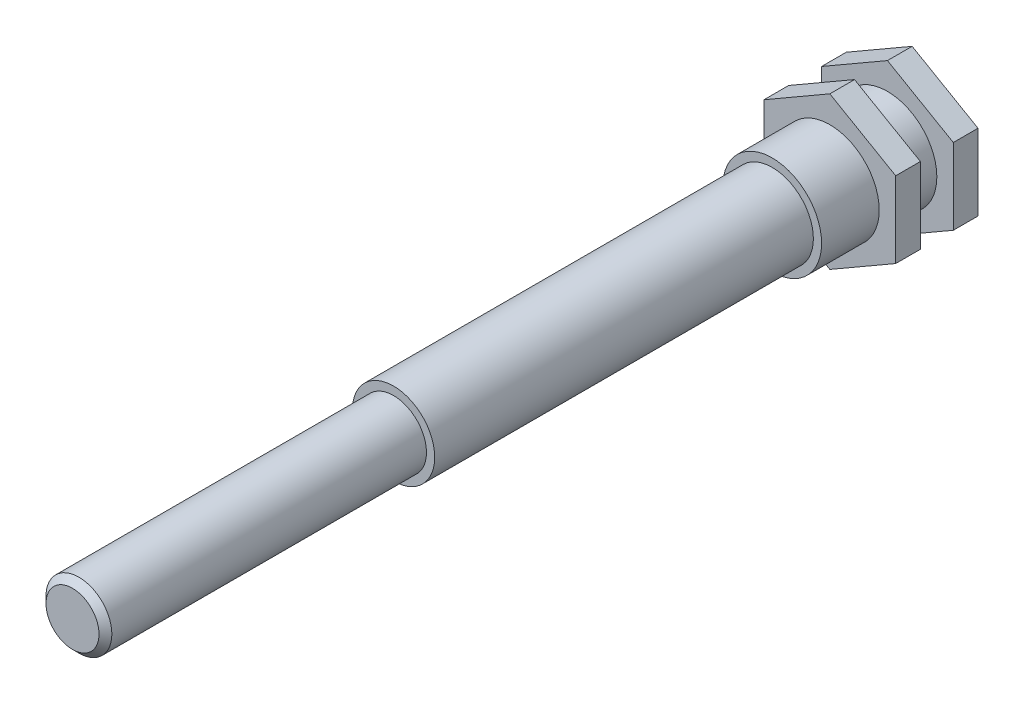
ISO-10303-21;
HEADER;
FILE_DESCRIPTION(('STEP AP214'),'2;1');
FILE_NAME('part.step','',(''),(''),'','','');
FILE_SCHEMA(('AUTOMOTIVE_DESIGN { 1 0 10303 214 1 1 1 1 }'));
ENDSEC;
DATA;
#1=APPLICATION_CONTEXT('core data for automotive mechanical design processes');
#2=APPLICATION_PROTOCOL_DEFINITION('international standard','automotive_design',2000,#1);
#3=PRODUCT_CONTEXT('',#1,'mechanical');
#4=PRODUCT('Part','Part','',(#3));
#5=PRODUCT_RELATED_PRODUCT_CATEGORY('part','',(#4));
#6=PRODUCT_DEFINITION_FORMATION('','',#4);
#7=PRODUCT_DEFINITION_CONTEXT('part definition',#1,'design');
#8=PRODUCT_DEFINITION('design','',#6,#7);
#9=PRODUCT_DEFINITION_SHAPE('','',#8);
#10=(LENGTH_UNIT() NAMED_UNIT(*) SI_UNIT(.MILLI.,.METRE.));
#11=(NAMED_UNIT(*) PLANE_ANGLE_UNIT() SI_UNIT($,.RADIAN.));
#12=(NAMED_UNIT(*) SI_UNIT($,.STERADIAN.) SOLID_ANGLE_UNIT());
#13=UNCERTAINTY_MEASURE_WITH_UNIT(LENGTH_MEASURE(1.E-05),#10,'distance_accuracy_value','');
#14=(GEOMETRIC_REPRESENTATION_CONTEXT(3) GLOBAL_UNCERTAINTY_ASSIGNED_CONTEXT((#13)) GLOBAL_UNIT_ASSIGNED_CONTEXT((#10,
#11,#12)) REPRESENTATION_CONTEXT('',''));
#15=CARTESIAN_POINT('',(0.,0.,0.));
#16=DIRECTION('',(0.,0.,1.));
#17=DIRECTION('',(1.,0.,0.));
#18=AXIS2_PLACEMENT_3D('',#15,#16,#17);
#19=CARTESIAN_POINT('',(0.,0.,31.4999999999998));
#20=DIRECTION('',(0.,0.,0.999999999999996));
#21=DIRECTION('',(1.,0.,0.));
#22=AXIS2_PLACEMENT_3D('',#19,#20,#21);
#23=PLANE('',#22);
#24=CARTESIAN_POINT('',(0.,0.,31.4999999999998));
#25=DIRECTION('',(0.,0.,0.999999999999996));
#26=DIRECTION('',(1.,0.,0.));
#27=AXIS2_PLACEMENT_3D('',#24,#25,#26);
#28=CIRCLE('',#27,2.5);
#29=CARTESIAN_POINT('',(2.5,0.,31.4999999999998));
#30=VERTEX_POINT('',#29);
#31=EDGE_CURVE('E293',#30,#30,#28,.T.);
#32=ORIENTED_EDGE('',*,*,#31,.T.);
#33=EDGE_LOOP('',(#32));
#34=FACE_BOUND('',#33,.T.);
#35=CARTESIAN_POINT('',(0.,0.,31.4999999999998));
#36=DIRECTION('',(0.,0.,0.999999999999996));
#37=DIRECTION('',(1.,0.,0.));
#38=AXIS2_PLACEMENT_3D('',#35,#36,#37);
#39=CIRCLE('',#38,2.);
#40=CARTESIAN_POINT('',(2.,0.,31.4999999999998));
#41=VERTEX_POINT('',#40);
#42=EDGE_CURVE('E313',#41,#41,#39,.T.);
#43=ORIENTED_EDGE('',*,*,#42,.F.);
#44=EDGE_LOOP('',(#43));
#45=FACE_BOUND('',#44,.T.);
#46=ADVANCED_FACE('F36',(#34,#45),#23,.T.);
#47=CARTESIAN_POINT('',(0.,0.,8.49999999999994));
#48=DIRECTION('',(0.,0.,0.999999999999996));
#49=DIRECTION('',(1.,0.,0.));
#50=AXIS2_PLACEMENT_3D('',#47,#48,#49);
#51=PLANE('',#50);
#52=CARTESIAN_POINT('',(0.,0.,8.49999999999994));
#53=DIRECTION('',(0.,0.,0.999999999999996));
#54=DIRECTION('',(1.,0.,0.));
#55=AXIS2_PLACEMENT_3D('',#52,#53,#54);
#56=CIRCLE('',#55,3.);
#57=CARTESIAN_POINT('',(3.,0.,8.49999999999994));
#58=VERTEX_POINT('',#57);
#59=EDGE_CURVE('E131',#58,#58,#56,.T.);
#60=ORIENTED_EDGE('',*,*,#59,.T.);
#61=EDGE_LOOP('',(#60));
#62=FACE_BOUND('',#61,.T.);
#63=CARTESIAN_POINT('',(0.,0.,8.49999999999994));
#64=DIRECTION('',(0.,0.,0.999999999999996));
#65=DIRECTION('',(1.,0.,0.));
#66=AXIS2_PLACEMENT_3D('',#63,#64,#65);
#67=CIRCLE('',#66,2.5);
#68=CARTESIAN_POINT('',(2.5,0.,8.49999999999994));
#69=VERTEX_POINT('',#68);
#70=EDGE_CURVE('E310',#69,#69,#67,.T.);
#71=ORIENTED_EDGE('',*,*,#70,.F.);
#72=EDGE_LOOP('',(#71));
#73=FACE_BOUND('',#72,.T.);
#74=ADVANCED_FACE('F168',(#62,#73),#51,.T.);
#75=CARTESIAN_POINT('',(0.,0.,8.49999999999994));
#76=DIRECTION('',(0.,0.,-0.999999999999996));
#77=DIRECTION('',(-1.,0.,0.));
#78=AXIS2_PLACEMENT_3D('',#75,#76,#77);
#79=CYLINDRICAL_SURFACE('',#78,3.);
#80=CARTESIAN_POINT('',(0.,0.,1.49999999999999));
#81=DIRECTION('',(0.,0.,0.999999999999996));
#82=DIRECTION('',(1.,0.,0.));
#83=AXIS2_PLACEMENT_3D('',#80,#81,#82);
#84=CIRCLE('',#83,3.);
#85=CARTESIAN_POINT('',(3.,0.,1.49999999999999));
#86=VERTEX_POINT('',#85);
#87=EDGE_CURVE('E152',#86,#86,#84,.T.);
#88=ORIENTED_EDGE('',*,*,#87,.T.);
#89=EDGE_LOOP('',(#88));
#90=FACE_BOUND('',#89,.T.);
#91=CARTESIAN_POINT('',(0.,0.,3.49999999999997));
#92=DIRECTION('',(0.,0.,0.999999999999996));
#93=DIRECTION('',(1.,0.,0.));
#94=AXIS2_PLACEMENT_3D('',#91,#92,#93);
#95=CIRCLE('',#94,3.);
#96=CARTESIAN_POINT('',(3.,0.,3.49999999999997));
#97=VERTEX_POINT('',#96);
#98=EDGE_CURVE('E147',#97,#97,#95,.T.);
#99=ORIENTED_EDGE('',*,*,#98,.F.);
#100=EDGE_LOOP('',(#99));
#101=FACE_BOUND('',#100,.T.);
#102=ADVANCED_FACE('F174',(#90,#101),#79,.T.);
#103=CARTESIAN_POINT('',(0.,0.,1.49999999999999));
#104=DIRECTION('',(0.,0.,0.999999999999996));
#105=DIRECTION('',(1.,0.,0.));
#106=AXIS2_PLACEMENT_3D('',#103,#104,#105);
#107=PLANE('',#106);
#108=DIRECTION('',(-0.866025403784439,-0.500000000000001,0.));
#109=VECTOR('',#108,1.);
#110=CARTESIAN_POINT('',(0.,4.61880215351702,1.49999999999999));
#111=LINE('',#110,#109);
#112=CARTESIAN_POINT('',(0.,4.61880215351702,1.49999999999999));
#113=VERTEX_POINT('',#112);
#114=CARTESIAN_POINT('',(-4.00000000000001,2.30940107675851,1.5));
#115=VERTEX_POINT('',#114);
#116=EDGE_CURVE('E138',#113,#115,#111,.T.);
#117=ORIENTED_EDGE('',*,*,#116,.T.);
#118=DIRECTION('',(0.,-1.,0.));
#119=VECTOR('',#118,1.);
#120=CARTESIAN_POINT('',(-4.00000000000001,2.30940107675851,1.5));
#121=LINE('',#120,#119);
#122=CARTESIAN_POINT('',(-4.,-2.30940107675851,1.5));
#123=VERTEX_POINT('',#122);
#124=EDGE_CURVE('E92',#115,#123,#121,.T.);
#125=ORIENTED_EDGE('',*,*,#124,.T.);
#126=DIRECTION('',(0.866025403784441,-0.500000000000001,0.));
#127=VECTOR('',#126,1.);
#128=CARTESIAN_POINT('',(-4.,-2.30940107675851,1.5));
#129=LINE('',#128,#127);
#130=CARTESIAN_POINT('',(0.,-4.61880215351701,1.49999999999999));
#131=VERTEX_POINT('',#130);
#132=EDGE_CURVE('E109',#123,#131,#129,.T.);
#133=ORIENTED_EDGE('',*,*,#132,.T.);
#134=DIRECTION('',(0.866025403784439,0.500000000000001,0.));
#135=VECTOR('',#134,1.);
#136=CARTESIAN_POINT('',(0.,-4.61880215351701,1.49999999999999));
#137=LINE('',#136,#135);
#138=CARTESIAN_POINT('',(4.,-2.3094010767585,1.49999999999999));
#139=VERTEX_POINT('',#138);
#140=EDGE_CURVE('E102',#131,#139,#137,.T.);
#141=ORIENTED_EDGE('',*,*,#140,.T.);
#142=DIRECTION('',(0.,1.,0.));
#143=VECTOR('',#142,1.);
#144=CARTESIAN_POINT('',(4.,-2.3094010767585,1.49999999999999));
#145=LINE('',#144,#143);
#146=CARTESIAN_POINT('',(4.00000000000002,2.30940107675851,1.49999999999999));
#147=VERTEX_POINT('',#146);
#148=EDGE_CURVE('E107',#139,#147,#145,.T.);
#149=ORIENTED_EDGE('',*,*,#148,.T.);
#150=DIRECTION('',(-0.866025403784441,0.500000000000001,0.));
#151=VECTOR('',#150,1.);
#152=CARTESIAN_POINT('',(4.00000000000002,2.30940107675851,1.49999999999999));
#153=LINE('',#152,#151);
#154=EDGE_CURVE('E53',#147,#113,#153,.T.);
#155=ORIENTED_EDGE('',*,*,#154,.T.);
#156=EDGE_LOOP('',(#117,#125,#133,#141,#149,#155));
#157=FACE_BOUND('',#156,.T.);
#158=ORIENTED_EDGE('',*,*,#87,.F.);
#159=EDGE_LOOP('',(#158));
#160=FACE_BOUND('',#159,.T.);
#161=ADVANCED_FACE('F104',(#157,#160),#107,.T.);
#162=CARTESIAN_POINT('',(0.,4.61880215351702,1.49999999999999));
#163=DIRECTION('',(0.500000000000001,-0.86602540378444,0.));
#164=DIRECTION('',(0.866025403784439,0.500000000000001,0.));
#165=AXIS2_PLACEMENT_3D('',#162,#163,#164);
#166=PLANE('',#165);
#167=DIRECTION('',(-0.866025403784439,-0.500000000000001,0.));
#168=VECTOR('',#167,1.);
#169=CARTESIAN_POINT('',(0.,4.61880215351702,0.));
#170=LINE('',#169,#168);
#171=CARTESIAN_POINT('',(0.,4.61880215351702,0.));
#172=VERTEX_POINT('',#171);
#173=CARTESIAN_POINT('',(-4.00000000000001,2.30940107675851,0.));
#174=VERTEX_POINT('',#173);
#175=EDGE_CURVE('E127',#172,#174,#170,.T.);
#176=ORIENTED_EDGE('',*,*,#175,.T.);
#177=DIRECTION('',(0.,0.,-0.999999999999996));
#178=VECTOR('',#177,1.);
#179=CARTESIAN_POINT('',(-4.00000000000001,2.30940107675851,1.5));
#180=LINE('',#179,#178);
#181=EDGE_CURVE('E145',#115,#174,#180,.T.);
#182=ORIENTED_EDGE('',*,*,#181,.F.);
#183=ORIENTED_EDGE('',*,*,#116,.F.);
#184=DIRECTION('',(0.,0.,-0.999999999999996));
#185=VECTOR('',#184,1.);
#186=CARTESIAN_POINT('',(0.,4.61880215351702,1.49999999999999));
#187=LINE('',#186,#185);
#188=EDGE_CURVE('E123',#113,#172,#187,.T.);
#189=ORIENTED_EDGE('',*,*,#188,.T.);
#190=EDGE_LOOP('',(#176,#182,#183,#189));
#191=FACE_BOUND('',#190,.T.);
#192=ADVANCED_FACE('F224',(#191),#166,.F.);
#193=CARTESIAN_POINT('',(-4.00000000000001,2.30940107675851,1.5));
#194=DIRECTION('',(1.,0.,0.));
#195=DIRECTION('',(0.,0.,-0.999999999999996));
#196=AXIS2_PLACEMENT_3D('',#193,#194,#195);
#197=PLANE('',#196);
#198=DIRECTION('',(0.,-1.,0.));
#199=VECTOR('',#198,1.);
#200=CARTESIAN_POINT('',(-4.00000000000001,2.30940107675851,0.));
#201=LINE('',#200,#199);
#202=CARTESIAN_POINT('',(-4.,-2.30940107675851,0.));
#203=VERTEX_POINT('',#202);
#204=EDGE_CURVE('E130',#174,#203,#201,.T.);
#205=ORIENTED_EDGE('',*,*,#204,.T.);
#206=DIRECTION('',(0.,0.,-0.999999999999996));
#207=VECTOR('',#206,1.);
#208=CARTESIAN_POINT('',(-4.,-2.30940107675851,1.5));
#209=LINE('',#208,#207);
#210=EDGE_CURVE('E142',#123,#203,#209,.T.);
#211=ORIENTED_EDGE('',*,*,#210,.F.);
#212=ORIENTED_EDGE('',*,*,#124,.F.);
#213=ORIENTED_EDGE('',*,*,#181,.T.);
#214=EDGE_LOOP('',(#205,#211,#212,#213));
#215=FACE_BOUND('',#214,.T.);
#216=ADVANCED_FACE('F238',(#215),#197,.F.);
#217=CARTESIAN_POINT('',(-4.,-2.30940107675851,1.5));
#218=DIRECTION('',(0.5,0.866025403784441,0.));
#219=DIRECTION('',(-0.866025403784441,0.500000000000001,0.));
#220=AXIS2_PLACEMENT_3D('',#217,#218,#219);
#221=PLANE('',#220);
#222=DIRECTION('',(0.866025403784441,-0.500000000000001,0.));
#223=VECTOR('',#222,1.);
#224=CARTESIAN_POINT('',(-4.,-2.30940107675851,0.));
#225=LINE('',#224,#223);
#226=CARTESIAN_POINT('',(0.,-4.61880215351701,0.));
#227=VERTEX_POINT('',#226);
#228=EDGE_CURVE('E133',#203,#227,#225,.T.);
#229=ORIENTED_EDGE('',*,*,#228,.T.);
#230=DIRECTION('',(0.,0.,-0.999999999999996));
#231=VECTOR('',#230,1.);
#232=CARTESIAN_POINT('',(0.,-4.61880215351701,1.49999999999999));
#233=LINE('',#232,#231);
#234=EDGE_CURVE('E118',#131,#227,#233,.T.);
#235=ORIENTED_EDGE('',*,*,#234,.F.);
#236=ORIENTED_EDGE('',*,*,#132,.F.);
#237=ORIENTED_EDGE('',*,*,#210,.T.);
#238=EDGE_LOOP('',(#229,#235,#236,#237));
#239=FACE_BOUND('',#238,.T.);
#240=ADVANCED_FACE('F235',(#239),#221,.F.);
#241=CARTESIAN_POINT('',(0.,-4.61880215351701,1.49999999999999));
#242=DIRECTION('',(-0.500000000000001,0.86602540378444,0.));
#243=DIRECTION('',(-0.866025403784439,-0.500000000000001,0.));
#244=AXIS2_PLACEMENT_3D('',#241,#242,#243);
#245=PLANE('',#244);
#246=DIRECTION('',(0.866025403784439,0.500000000000001,0.));
#247=VECTOR('',#246,1.);
#248=CARTESIAN_POINT('',(0.,-4.61880215351701,0.));
#249=LINE('',#248,#247);
#250=CARTESIAN_POINT('',(4.,-2.3094010767585,0.));
#251=VERTEX_POINT('',#250);
#252=EDGE_CURVE('E117',#227,#251,#249,.T.);
#253=ORIENTED_EDGE('',*,*,#252,.T.);
#254=DIRECTION('',(0.,0.,-0.999999999999996));
#255=VECTOR('',#254,1.);
#256=CARTESIAN_POINT('',(4.,-2.3094010767585,1.49999999999999));
#257=LINE('',#256,#255);
#258=EDGE_CURVE('E114',#139,#251,#257,.T.);
#259=ORIENTED_EDGE('',*,*,#258,.F.);
#260=ORIENTED_EDGE('',*,*,#140,.F.);
#261=ORIENTED_EDGE('',*,*,#234,.T.);
#262=EDGE_LOOP('',(#253,#259,#260,#261));
#263=FACE_BOUND('',#262,.T.);
#264=ADVANCED_FACE('F115',(#263),#245,.F.);
#265=CARTESIAN_POINT('',(4.,-2.3094010767585,1.49999999999999));
#266=DIRECTION('',(-1.,0.,0.));
#267=DIRECTION('',(0.,-1.,0.));
#268=AXIS2_PLACEMENT_3D('',#265,#266,#267);
#269=PLANE('',#268);
#270=DIRECTION('',(0.,1.,0.));
#271=VECTOR('',#270,1.);
#272=CARTESIAN_POINT('',(4.,-2.3094010767585,0.));
#273=LINE('',#272,#271);
#274=CARTESIAN_POINT('',(4.00000000000002,2.30940107675851,0.));
#275=VERTEX_POINT('',#274);
#276=EDGE_CURVE('E77',#251,#275,#273,.T.);
#277=ORIENTED_EDGE('',*,*,#276,.T.);
#278=DIRECTION('',(0.,0.,-0.999999999999996));
#279=VECTOR('',#278,1.);
#280=CARTESIAN_POINT('',(4.00000000000002,2.30940107675851,1.49999999999999));
#281=LINE('',#280,#279);
#282=EDGE_CURVE('E119',#147,#275,#281,.T.);
#283=ORIENTED_EDGE('',*,*,#282,.F.);
#284=ORIENTED_EDGE('',*,*,#148,.F.);
#285=ORIENTED_EDGE('',*,*,#258,.T.);
#286=EDGE_LOOP('',(#277,#283,#284,#285));
#287=FACE_BOUND('',#286,.T.);
#288=ADVANCED_FACE('F121',(#287),#269,.F.);
#289=CARTESIAN_POINT('',(4.00000000000002,2.30940107675851,1.49999999999999));
#290=DIRECTION('',(-0.500000000000001,-0.866025403784441,0.));
#291=DIRECTION('',(0.866025403784441,-0.500000000000001,0.));
#292=AXIS2_PLACEMENT_3D('',#289,#290,#291);
#293=PLANE('',#292);
#294=DIRECTION('',(-0.866025403784441,0.500000000000001,0.));
#295=VECTOR('',#294,1.);
#296=CARTESIAN_POINT('',(4.00000000000002,2.30940107675851,0.));
#297=LINE('',#296,#295);
#298=EDGE_CURVE('E83',#275,#172,#297,.T.);
#299=ORIENTED_EDGE('',*,*,#298,.T.);
#300=ORIENTED_EDGE('',*,*,#188,.F.);
#301=ORIENTED_EDGE('',*,*,#154,.F.);
#302=ORIENTED_EDGE('',*,*,#282,.T.);
#303=EDGE_LOOP('',(#299,#300,#301,#302));
#304=FACE_BOUND('',#303,.T.);
#305=ADVANCED_FACE('F227',(#304),#293,.F.);
#306=CARTESIAN_POINT('',(0.,0.,0.));
#307=DIRECTION('',(0.,0.,0.999999999999996));
#308=DIRECTION('',(1.,0.,0.));
#309=AXIS2_PLACEMENT_3D('',#306,#307,#308);
#310=PLANE('',#309);
#311=ORIENTED_EDGE('',*,*,#175,.F.);
#312=ORIENTED_EDGE('',*,*,#298,.F.);
#313=ORIENTED_EDGE('',*,*,#276,.F.);
#314=ORIENTED_EDGE('',*,*,#252,.F.);
#315=ORIENTED_EDGE('',*,*,#228,.F.);
#316=ORIENTED_EDGE('',*,*,#204,.F.);
#317=EDGE_LOOP('',(#311,#312,#313,#314,#315,#316));
#318=FACE_BOUND('',#317,.T.);
#319=ADVANCED_FACE('F190',(#318),#310,.F.);
#320=CARTESIAN_POINT('',(0.,0.,4.99999999999997));
#321=DIRECTION('',(0.,0.,0.999999999999996));
#322=DIRECTION('',(1.,0.,0.));
#323=AXIS2_PLACEMENT_3D('',#320,#321,#322);
#324=PLANE('',#323);
#325=DIRECTION('',(-0.866025403784439,-0.500000000000001,0.));
#326=VECTOR('',#325,1.);
#327=CARTESIAN_POINT('',(0.,4.61880215351702,4.99999999999997));
#328=LINE('',#327,#326);
#329=CARTESIAN_POINT('',(0.,4.61880215351702,4.99999999999997));
#330=VERTEX_POINT('',#329);
#331=CARTESIAN_POINT('',(-4.00000000000001,2.30940107675852,4.99999999999997));
#332=VERTEX_POINT('',#331);
#333=EDGE_CURVE('E277',#330,#332,#328,.T.);
#334=ORIENTED_EDGE('',*,*,#333,.T.);
#335=DIRECTION('',(0.,-1.,0.));
#336=VECTOR('',#335,1.);
#337=CARTESIAN_POINT('',(-4.00000000000001,2.30940107675852,4.99999999999997));
#338=LINE('',#337,#336);
#339=CARTESIAN_POINT('',(-4.,-2.30940107675851,4.99999999999997));
#340=VERTEX_POINT('',#339);
#341=EDGE_CURVE('E305',#332,#340,#338,.T.);
#342=ORIENTED_EDGE('',*,*,#341,.T.);
#343=DIRECTION('',(0.866025403784441,-0.500000000000001,0.));
#344=VECTOR('',#343,1.);
#345=CARTESIAN_POINT('',(-4.,-2.30940107675851,4.99999999999997));
#346=LINE('',#345,#344);
#347=CARTESIAN_POINT('',(0.,-4.61880215351701,4.99999999999997));
#348=VERTEX_POINT('',#347);
#349=EDGE_CURVE('E302',#340,#348,#346,.T.);
#350=ORIENTED_EDGE('',*,*,#349,.T.);
#351=DIRECTION('',(0.866025403784439,0.500000000000001,0.));
#352=VECTOR('',#351,1.);
#353=CARTESIAN_POINT('',(0.,-4.61880215351701,4.99999999999997));
#354=LINE('',#353,#352);
#355=CARTESIAN_POINT('',(4.,-2.3094010767585,4.99999999999997));
#356=VERTEX_POINT('',#355);
#357=EDGE_CURVE('E299',#348,#356,#354,.T.);
#358=ORIENTED_EDGE('',*,*,#357,.T.);
#359=DIRECTION('',(0.,1.,0.));
#360=VECTOR('',#359,1.);
#361=CARTESIAN_POINT('',(4.,-2.3094010767585,4.99999999999997));
#362=LINE('',#361,#360);
#363=CARTESIAN_POINT('',(4.00000000000002,2.30940107675851,4.99999999999997));
#364=VERTEX_POINT('',#363);
#365=EDGE_CURVE('E296',#356,#364,#362,.T.);
#366=ORIENTED_EDGE('',*,*,#365,.T.);
#367=DIRECTION('',(-0.866025403784441,0.500000000000001,0.));
#368=VECTOR('',#367,1.);
#369=CARTESIAN_POINT('',(4.00000000000002,2.30940107675851,4.99999999999997));
#370=LINE('',#369,#368);
#371=EDGE_CURVE('E273',#364,#330,#370,.T.);
#372=ORIENTED_EDGE('',*,*,#371,.T.);
#373=EDGE_LOOP('',(#334,#342,#350,#358,#366,#372));
#374=FACE_BOUND('',#373,.T.);
#375=CARTESIAN_POINT('',(0.,0.,4.99999999999997));
#376=DIRECTION('',(0.,0.,0.999999999999996));
#377=DIRECTION('',(1.,0.,0.));
#378=AXIS2_PLACEMENT_3D('',#375,#376,#377);
#379=CIRCLE('',#378,3.);
#380=CARTESIAN_POINT('',(3.,0.,4.99999999999997));
#381=VERTEX_POINT('',#380);
#382=EDGE_CURVE('E150',#381,#381,#379,.T.);
#383=ORIENTED_EDGE('',*,*,#382,.F.);
#384=EDGE_LOOP('',(#383));
#385=FACE_BOUND('',#384,.T.);
#386=ADVANCED_FACE('F186',(#374,#385),#324,.T.);
#387=CARTESIAN_POINT('',(0.,0.,3.49999999999997));
#388=DIRECTION('',(0.,0.,0.999999999999996));
#389=DIRECTION('',(1.,0.,0.));
#390=AXIS2_PLACEMENT_3D('',#387,#388,#389);
#391=PLANE('',#390);
#392=DIRECTION('',(-0.866025403784439,-0.500000000000001,0.));
#393=VECTOR('',#392,1.);
#394=CARTESIAN_POINT('',(0.,4.61880215351702,3.49999999999997));
#395=LINE('',#394,#393);
#396=CARTESIAN_POINT('',(0.,4.61880215351702,3.49999999999997));
#397=VERTEX_POINT('',#396);
#398=CARTESIAN_POINT('',(-4.00000000000001,2.30940107675852,3.49999999999997));
#399=VERTEX_POINT('',#398);
#400=EDGE_CURVE('E290',#397,#399,#395,.T.);
#401=ORIENTED_EDGE('',*,*,#400,.F.);
#402=DIRECTION('',(-0.866025403784441,0.500000000000001,0.));
#403=VECTOR('',#402,1.);
#404=CARTESIAN_POINT('',(4.00000000000002,2.30940107675851,3.49999999999997));
#405=LINE('',#404,#403);
#406=CARTESIAN_POINT('',(4.00000000000002,2.30940107675851,3.49999999999997));
#407=VERTEX_POINT('',#406);
#408=EDGE_CURVE('E274',#407,#397,#405,.T.);
#409=ORIENTED_EDGE('',*,*,#408,.F.);
#410=DIRECTION('',(0.,1.,0.));
#411=VECTOR('',#410,1.);
#412=CARTESIAN_POINT('',(4.,-2.3094010767585,3.49999999999997));
#413=LINE('',#412,#411);
#414=CARTESIAN_POINT('',(4.,-2.3094010767585,3.49999999999997));
#415=VERTEX_POINT('',#414);
#416=EDGE_CURVE('E278',#415,#407,#413,.T.);
#417=ORIENTED_EDGE('',*,*,#416,.F.);
#418=DIRECTION('',(0.866025403784439,0.500000000000001,0.));
#419=VECTOR('',#418,1.);
#420=CARTESIAN_POINT('',(0.,-4.61880215351701,3.49999999999997));
#421=LINE('',#420,#419);
#422=CARTESIAN_POINT('',(0.,-4.61880215351701,3.49999999999997));
#423=VERTEX_POINT('',#422);
#424=EDGE_CURVE('E281',#423,#415,#421,.T.);
#425=ORIENTED_EDGE('',*,*,#424,.F.);
#426=DIRECTION('',(0.866025403784441,-0.500000000000001,0.));
#427=VECTOR('',#426,1.);
#428=CARTESIAN_POINT('',(-4.,-2.30940107675851,3.49999999999997));
#429=LINE('',#428,#427);
#430=CARTESIAN_POINT('',(-4.,-2.30940107675851,3.49999999999997));
#431=VERTEX_POINT('',#430);
#432=EDGE_CURVE('E284',#431,#423,#429,.T.);
#433=ORIENTED_EDGE('',*,*,#432,.F.);
#434=DIRECTION('',(0.,-1.,0.));
#435=VECTOR('',#434,1.);
#436=CARTESIAN_POINT('',(-4.00000000000001,2.30940107675852,3.49999999999997));
#437=LINE('',#436,#435);
#438=EDGE_CURVE('E287',#399,#431,#437,.T.);
#439=ORIENTED_EDGE('',*,*,#438,.F.);
#440=EDGE_LOOP('',(#401,#409,#417,#425,#433,#439));
#441=FACE_BOUND('',#440,.T.);
#442=ORIENTED_EDGE('',*,*,#98,.T.);
#443=EDGE_LOOP('',(#442));
#444=FACE_BOUND('',#443,.T.);
#445=ADVANCED_FACE('F189',(#441,#444),#391,.F.);
#446=CARTESIAN_POINT('',(0.,4.61880215351702,4.99999999999997));
#447=DIRECTION('',(0.500000000000001,-0.86602540378444,0.));
#448=DIRECTION('',(0.866025403784439,0.500000000000001,0.));
#449=AXIS2_PLACEMENT_3D('',#446,#447,#448);
#450=PLANE('',#449);
#451=ORIENTED_EDGE('',*,*,#400,.T.);
#452=DIRECTION('',(0.,0.,-0.999999999999996));
#453=VECTOR('',#452,1.);
#454=CARTESIAN_POINT('',(-4.00000000000001,2.30940107675852,4.99999999999997));
#455=LINE('',#454,#453);
#456=EDGE_CURVE('E153',#332,#399,#455,.T.);
#457=ORIENTED_EDGE('',*,*,#456,.F.);
#458=ORIENTED_EDGE('',*,*,#333,.F.);
#459=DIRECTION('',(0.,0.,-0.999999999999996));
#460=VECTOR('',#459,1.);
#461=CARTESIAN_POINT('',(0.,4.61880215351702,4.99999999999997));
#462=LINE('',#461,#460);
#463=EDGE_CURVE('E270',#330,#397,#462,.T.);
#464=ORIENTED_EDGE('',*,*,#463,.T.);
#465=EDGE_LOOP('',(#451,#457,#458,#464));
#466=FACE_BOUND('',#465,.T.);
#467=ADVANCED_FACE('F194',(#466),#450,.F.);
#468=CARTESIAN_POINT('',(-4.00000000000001,2.30940107675852,4.99999999999997));
#469=DIRECTION('',(1.,0.,0.));
#470=DIRECTION('',(0.,0.,-0.999999999999996));
#471=AXIS2_PLACEMENT_3D('',#468,#469,#470);
#472=PLANE('',#471);
#473=ORIENTED_EDGE('',*,*,#438,.T.);
#474=DIRECTION('',(0.,0.,-0.999999999999996));
#475=VECTOR('',#474,1.);
#476=CARTESIAN_POINT('',(-4.,-2.30940107675851,4.99999999999997));
#477=LINE('',#476,#475);
#478=EDGE_CURVE('E258',#340,#431,#477,.T.);
#479=ORIENTED_EDGE('',*,*,#478,.F.);
#480=ORIENTED_EDGE('',*,*,#341,.F.);
#481=ORIENTED_EDGE('',*,*,#456,.T.);
#482=EDGE_LOOP('',(#473,#479,#480,#481));
#483=FACE_BOUND('',#482,.T.);
#484=ADVANCED_FACE('F211',(#483),#472,.F.);
#485=CARTESIAN_POINT('',(-4.,-2.30940107675851,4.99999999999997));
#486=DIRECTION('',(0.5,0.866025403784441,0.));
#487=DIRECTION('',(-0.866025403784441,0.500000000000001,0.));
#488=AXIS2_PLACEMENT_3D('',#485,#486,#487);
#489=PLANE('',#488);
#490=ORIENTED_EDGE('',*,*,#432,.T.);
#491=DIRECTION('',(0.,0.,-0.999999999999996));
#492=VECTOR('',#491,1.);
#493=CARTESIAN_POINT('',(0.,-4.61880215351701,4.99999999999997));
#494=LINE('',#493,#492);
#495=EDGE_CURVE('E261',#348,#423,#494,.T.);
#496=ORIENTED_EDGE('',*,*,#495,.F.);
#497=ORIENTED_EDGE('',*,*,#349,.F.);
#498=ORIENTED_EDGE('',*,*,#478,.T.);
#499=EDGE_LOOP('',(#490,#496,#497,#498));
#500=FACE_BOUND('',#499,.T.);
#501=ADVANCED_FACE('F207',(#500),#489,.F.);
#502=CARTESIAN_POINT('',(0.,-4.61880215351701,4.99999999999997));
#503=DIRECTION('',(-0.500000000000001,0.86602540378444,0.));
#504=DIRECTION('',(-0.866025403784439,-0.500000000000001,0.));
#505=AXIS2_PLACEMENT_3D('',#502,#503,#504);
#506=PLANE('',#505);
#507=ORIENTED_EDGE('',*,*,#424,.T.);
#508=DIRECTION('',(0.,0.,-0.999999999999996));
#509=VECTOR('',#508,1.);
#510=CARTESIAN_POINT('',(4.,-2.3094010767585,4.99999999999997));
#511=LINE('',#510,#509);
#512=EDGE_CURVE('E264',#356,#415,#511,.T.);
#513=ORIENTED_EDGE('',*,*,#512,.F.);
#514=ORIENTED_EDGE('',*,*,#357,.F.);
#515=ORIENTED_EDGE('',*,*,#495,.T.);
#516=EDGE_LOOP('',(#507,#513,#514,#515));
#517=FACE_BOUND('',#516,.T.);
#518=ADVANCED_FACE('F203',(#517),#506,.F.);
#519=CARTESIAN_POINT('',(4.,-2.3094010767585,4.99999999999997));
#520=DIRECTION('',(-1.,0.,0.));
#521=DIRECTION('',(0.,-1.,0.));
#522=AXIS2_PLACEMENT_3D('',#519,#520,#521);
#523=PLANE('',#522);
#524=ORIENTED_EDGE('',*,*,#416,.T.);
#525=DIRECTION('',(0.,0.,-0.999999999999996));
#526=VECTOR('',#525,1.);
#527=CARTESIAN_POINT('',(4.00000000000002,2.30940107675851,4.99999999999997));
#528=LINE('',#527,#526);
#529=EDGE_CURVE('E267',#364,#407,#528,.T.);
#530=ORIENTED_EDGE('',*,*,#529,.F.);
#531=ORIENTED_EDGE('',*,*,#365,.F.);
#532=ORIENTED_EDGE('',*,*,#512,.T.);
#533=EDGE_LOOP('',(#524,#530,#531,#532));
#534=FACE_BOUND('',#533,.T.);
#535=ADVANCED_FACE('F199',(#534),#523,.F.);
#536=CARTESIAN_POINT('',(4.00000000000002,2.30940107675851,4.99999999999997));
#537=DIRECTION('',(-0.500000000000001,-0.866025403784441,0.));
#538=DIRECTION('',(0.866025403784441,-0.500000000000001,0.));
#539=AXIS2_PLACEMENT_3D('',#536,#537,#538);
#540=PLANE('',#539);
#541=ORIENTED_EDGE('',*,*,#408,.T.);
#542=ORIENTED_EDGE('',*,*,#463,.F.);
#543=ORIENTED_EDGE('',*,*,#371,.F.);
#544=ORIENTED_EDGE('',*,*,#529,.T.);
#545=EDGE_LOOP('',(#541,#542,#543,#544));
#546=FACE_BOUND('',#545,.T.);
#547=ADVANCED_FACE('F196',(#546),#540,.F.);
#548=ORIENTED_EDGE('',*,*,#382,.T.);
#549=EDGE_LOOP('',(#548));
#550=FACE_BOUND('',#549,.T.);
#551=ORIENTED_EDGE('',*,*,#59,.F.);
#552=EDGE_LOOP('',(#551));
#553=FACE_BOUND('',#552,.T.);
#554=ADVANCED_FACE('F184',(#550,#553),#79,.T.);
#555=CARTESIAN_POINT('',(0.,0.,31.4999999999998));
#556=DIRECTION('',(0.,0.,-0.999999999999996));
#557=DIRECTION('',(-1.,0.,0.));
#558=AXIS2_PLACEMENT_3D('',#555,#556,#557);
#559=CYLINDRICAL_SURFACE('',#558,2.5);
#560=ORIENTED_EDGE('',*,*,#31,.F.);
#561=EDGE_LOOP('',(#560));
#562=FACE_BOUND('',#561,.T.);
#563=ORIENTED_EDGE('',*,*,#70,.T.);
#564=EDGE_LOOP('',(#563));
#565=FACE_BOUND('',#564,.T.);
#566=ADVANCED_FACE('F181',(#562,#565),#559,.T.);
#567=CARTESIAN_POINT('',(0.,0.,50.9999999999998));
#568=DIRECTION('',(0.,0.,-0.999999999999996));
#569=DIRECTION('',(-1.,0.,0.));
#570=AXIS2_PLACEMENT_3D('',#567,#568,#569);
#571=CYLINDRICAL_SURFACE('',#570,2.);
#572=CARTESIAN_POINT('',(0.,0.,50.6099999999998));
#573=DIRECTION('',(0.,0.,0.999999999999996));
#574=DIRECTION('',(1.,0.,0.));
#575=AXIS2_PLACEMENT_3D('',#572,#573,#574);
#576=CIRCLE('',#575,2.);
#577=CARTESIAN_POINT('',(2.,0.,50.6099999999998));
#578=VERTEX_POINT('',#577);
#579=EDGE_CURVE('E11',#578,#578,#576,.F.);
#580=ORIENTED_EDGE('',*,*,#579,.T.);
#581=EDGE_LOOP('',(#580));
#582=FACE_BOUND('',#581,.T.);
#583=ORIENTED_EDGE('',*,*,#42,.T.);
#584=EDGE_LOOP('',(#583));
#585=FACE_BOUND('',#584,.T.);
#586=ADVANCED_FACE('F164',(#582,#585),#571,.T.);
#587=CARTESIAN_POINT('',(0.,0.,50.9999999999998));
#588=DIRECTION('',(0.,0.,0.999999999999996));
#589=DIRECTION('',(1.,0.,0.));
#590=AXIS2_PLACEMENT_3D('',#587,#588,#589);
#591=PLANE('',#590);
#592=CARTESIAN_POINT('',(0.,0.,50.9999999999998));
#593=DIRECTION('',(0.,0.,0.999999999999996));
#594=DIRECTION('',(1.,0.,0.));
#595=AXIS2_PLACEMENT_3D('',#592,#593,#594);
#596=CIRCLE('',#595,1.61);
#597=CARTESIAN_POINT('',(1.61,0.,50.9999999999998));
#598=VERTEX_POINT('',#597);
#599=EDGE_CURVE('E45',#598,#598,#596,.T.);
#600=ORIENTED_EDGE('',*,*,#599,.T.);
#601=EDGE_LOOP('',(#600));
#602=FACE_BOUND('',#601,.T.);
#603=ADVANCED_FACE('F157',(#602),#591,.T.);
#604=CARTESIAN_POINT('',(0.,0.,50.9999999999998));
#605=DIRECTION('',(0.,0.,-0.999999999999996));
#606=DIRECTION('',(-1.,0.,0.));
#607=AXIS2_PLACEMENT_3D('',#604,#605,#606);
#608=CONICAL_SURFACE('',#607,1.61,0.785398163397446);
#609=ORIENTED_EDGE('',*,*,#579,.F.);
#610=EDGE_LOOP('',(#609));
#611=FACE_BOUND('',#610,.T.);
#612=ORIENTED_EDGE('',*,*,#599,.F.);
#613=EDGE_LOOP('',(#612));
#614=FACE_BOUND('',#613,.T.);
#615=ADVANCED_FACE('F38',(#611,#614),#608,.T.);
#616=CLOSED_SHELL('',(#46,#74,#102,#161,#192,#216,#240,#264,#288,#305,#319,#386,#445,#467,#484,
#501,#518,#535,#547,#554,#566,#586,#603,#615));
#617=MANIFOLD_SOLID_BREP('B2',#616);
#618=ADVANCED_BREP_SHAPE_REPRESENTATION('',(#18,#617),#14);
#619=SHAPE_DEFINITION_REPRESENTATION(#9,#618);
ENDSEC;
END-ISO-10303-21;
